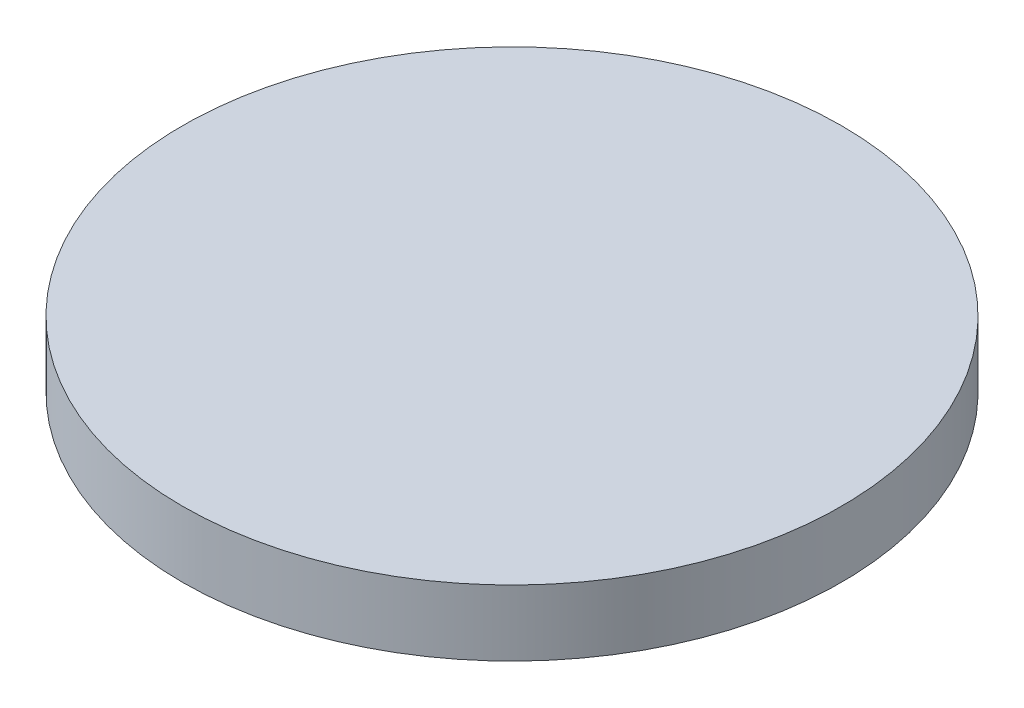
ISO-10303-21;
HEADER;
FILE_DESCRIPTION(('STEP AP214'),'2;1');
FILE_NAME('part.step','',(''),(''),'','','');
FILE_SCHEMA(('AUTOMOTIVE_DESIGN { 1 0 10303 214 1 1 1 1 }'));
ENDSEC;
DATA;
#1=APPLICATION_CONTEXT('core data for automotive mechanical design processes');
#2=APPLICATION_PROTOCOL_DEFINITION('international standard','automotive_design',2000,#1);
#3=PRODUCT_CONTEXT('',#1,'mechanical');
#4=PRODUCT('Part','Part','',(#3));
#5=PRODUCT_RELATED_PRODUCT_CATEGORY('part','',(#4));
#6=PRODUCT_DEFINITION_FORMATION('','',#4);
#7=PRODUCT_DEFINITION_CONTEXT('part definition',#1,'design');
#8=PRODUCT_DEFINITION('design','',#6,#7);
#9=PRODUCT_DEFINITION_SHAPE('','',#8);
#10=(LENGTH_UNIT() NAMED_UNIT(*) SI_UNIT(.MILLI.,.METRE.));
#11=(NAMED_UNIT(*) PLANE_ANGLE_UNIT() SI_UNIT($,.RADIAN.));
#12=(NAMED_UNIT(*) SI_UNIT($,.STERADIAN.) SOLID_ANGLE_UNIT());
#13=UNCERTAINTY_MEASURE_WITH_UNIT(LENGTH_MEASURE(1.E-05),#10,'distance_accuracy_value','');
#14=(GEOMETRIC_REPRESENTATION_CONTEXT(3) GLOBAL_UNCERTAINTY_ASSIGNED_CONTEXT((#13)) GLOBAL_UNIT_ASSIGNED_CONTEXT((#10,
#11,#12)) REPRESENTATION_CONTEXT('',''));
#15=CARTESIAN_POINT('',(0.,0.,0.));
#16=DIRECTION('',(0.,0.,1.));
#17=DIRECTION('',(1.,0.,0.));
#18=AXIS2_PLACEMENT_3D('',#15,#16,#17);
#19=CARTESIAN_POINT('',(0.,1.,0.));
#20=DIRECTION('',(0.,-1.,0.));
#21=DIRECTION('',(0.,0.,-1.));
#22=AXIS2_PLACEMENT_3D('',#19,#20,#21);
#23=CYLINDRICAL_SURFACE('',#22,5.);
#24=CARTESIAN_POINT('',(0.,1.,0.));
#25=DIRECTION('',(0.,1.,0.));
#26=DIRECTION('',(0.,0.,1.));
#27=AXIS2_PLACEMENT_3D('',#24,#25,#26);
#28=CIRCLE('',#27,5.);
#29=CARTESIAN_POINT('',(0.,1.,5.));
#30=VERTEX_POINT('',#29);
#31=EDGE_CURVE('E10',#30,#30,#28,.T.);
#32=ORIENTED_EDGE('',*,*,#31,.F.);
#33=EDGE_LOOP('',(#32));
#34=FACE_BOUND('',#33,.T.);
#35=CARTESIAN_POINT('',(0.,0.,0.));
#36=DIRECTION('',(0.,1.,0.));
#37=DIRECTION('',(0.,0.,1.));
#38=AXIS2_PLACEMENT_3D('',#35,#36,#37);
#39=CIRCLE('',#38,5.);
#40=CARTESIAN_POINT('',(0.,0.,5.));
#41=VERTEX_POINT('',#40);
#42=EDGE_CURVE('E34',#41,#41,#39,.T.);
#43=ORIENTED_EDGE('',*,*,#42,.T.);
#44=EDGE_LOOP('',(#43));
#45=FACE_BOUND('',#44,.T.);
#46=ADVANCED_FACE('F31',(#34,#45),#23,.T.);
#47=CARTESIAN_POINT('',(0.,1.,0.));
#48=DIRECTION('',(0.,1.,0.));
#49=DIRECTION('',(0.,0.,1.));
#50=AXIS2_PLACEMENT_3D('',#47,#48,#49);
#51=PLANE('',#50);
#52=ORIENTED_EDGE('',*,*,#31,.T.);
#53=EDGE_LOOP('',(#52));
#54=FACE_BOUND('',#53,.T.);
#55=ADVANCED_FACE('F46',(#54),#51,.T.);
#56=CARTESIAN_POINT('',(0.,0.,0.));
#57=DIRECTION('',(0.,1.,0.));
#58=DIRECTION('',(0.,0.,1.));
#59=AXIS2_PLACEMENT_3D('',#56,#57,#58);
#60=PLANE('',#59);
#61=ORIENTED_EDGE('',*,*,#42,.F.);
#62=EDGE_LOOP('',(#61));
#63=FACE_BOUND('',#62,.T.);
#64=ADVANCED_FACE('F44',(#63),#60,.F.);
#65=CLOSED_SHELL('',(#46,#55,#64));
#66=MANIFOLD_SOLID_BREP('B2',#65);
#67=ADVANCED_BREP_SHAPE_REPRESENTATION('',(#18,#66),#14);
#68=SHAPE_DEFINITION_REPRESENTATION(#9,#67);
ENDSEC;
END-ISO-10303-21;
